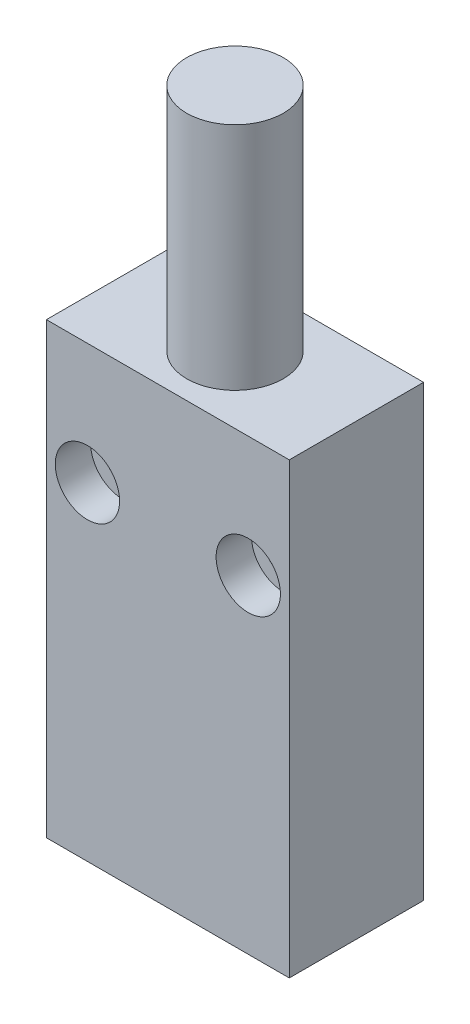
ISO-10303-21;
HEADER;
FILE_DESCRIPTION(('STEP AP214'),'2;1');
FILE_NAME('part.step','',(''),(''),'','','');
FILE_SCHEMA(('AUTOMOTIVE_DESIGN { 1 0 10303 214 1 1 1 1 }'));
ENDSEC;
DATA;
#1=APPLICATION_CONTEXT('core data for automotive mechanical design processes');
#2=APPLICATION_PROTOCOL_DEFINITION('international standard','automotive_design',2000,#1);
#3=PRODUCT_CONTEXT('',#1,'mechanical');
#4=PRODUCT('Part','Part','',(#3));
#5=PRODUCT_RELATED_PRODUCT_CATEGORY('part','',(#4));
#6=PRODUCT_DEFINITION_FORMATION('','',#4);
#7=PRODUCT_DEFINITION_CONTEXT('part definition',#1,'design');
#8=PRODUCT_DEFINITION('design','',#6,#7);
#9=PRODUCT_DEFINITION_SHAPE('','',#8);
#10=(LENGTH_UNIT() NAMED_UNIT(*) SI_UNIT(.MILLI.,.METRE.));
#11=(NAMED_UNIT(*) PLANE_ANGLE_UNIT() SI_UNIT($,.RADIAN.));
#12=(NAMED_UNIT(*) SI_UNIT($,.STERADIAN.) SOLID_ANGLE_UNIT());
#13=UNCERTAINTY_MEASURE_WITH_UNIT(LENGTH_MEASURE(1.E-05),#10,'distance_accuracy_value','');
#14=(GEOMETRIC_REPRESENTATION_CONTEXT(3) GLOBAL_UNCERTAINTY_ASSIGNED_CONTEXT((#13)) GLOBAL_UNIT_ASSIGNED_CONTEXT((#10,
#11,#12)) REPRESENTATION_CONTEXT('',''));
#15=CARTESIAN_POINT('',(0.,0.,0.));
#16=DIRECTION('',(0.,0.,1.));
#17=DIRECTION('',(1.,0.,0.));
#18=AXIS2_PLACEMENT_3D('',#15,#16,#17);
#19=CARTESIAN_POINT('',(-15.1,-27.9,8.35));
#20=DIRECTION('',(1.,0.,0.));
#21=DIRECTION('',(0.,0.,-1.));
#22=AXIS2_PLACEMENT_3D('',#19,#20,#21);
#23=PLANE('',#22);
#24=DIRECTION('',(0.,-1.,0.));
#25=VECTOR('',#24,1.);
#26=CARTESIAN_POINT('',(-15.1,-27.9,-8.35));
#27=LINE('',#26,#25);
#28=CARTESIAN_POINT('',(-15.1,27.9,-8.35));
#29=VERTEX_POINT('',#28);
#30=CARTESIAN_POINT('',(-15.1,-27.9,-8.35));
#31=VERTEX_POINT('',#30);
#32=EDGE_CURVE('E100',#29,#31,#27,.T.);
#33=ORIENTED_EDGE('',*,*,#32,.T.);
#34=DIRECTION('',(0.,0.,-1.));
#35=VECTOR('',#34,1.);
#36=CARTESIAN_POINT('',(-15.1,-27.9,8.35));
#37=LINE('',#36,#35);
#38=CARTESIAN_POINT('',(-15.1,-27.9,8.35));
#39=VERTEX_POINT('',#38);
#40=EDGE_CURVE('E42',#39,#31,#37,.T.);
#41=ORIENTED_EDGE('',*,*,#40,.F.);
#42=DIRECTION('',(0.,-1.,0.));
#43=VECTOR('',#42,1.);
#44=CARTESIAN_POINT('',(-15.1,-27.9,8.35));
#45=LINE('',#44,#43);
#46=CARTESIAN_POINT('',(-15.1,27.9,8.35));
#47=VERTEX_POINT('',#46);
#48=EDGE_CURVE('E86',#47,#39,#45,.T.);
#49=ORIENTED_EDGE('',*,*,#48,.F.);
#50=DIRECTION('',(0.,0.,-1.));
#51=VECTOR('',#50,1.);
#52=CARTESIAN_POINT('',(-15.1,27.9,8.35));
#53=LINE('',#52,#51);
#54=EDGE_CURVE('E96',#47,#29,#53,.T.);
#55=ORIENTED_EDGE('',*,*,#54,.T.);
#56=EDGE_LOOP('',(#33,#41,#49,#55));
#57=FACE_BOUND('',#56,.T.);
#58=ADVANCED_FACE('F34',(#57),#23,.F.);
#59=CARTESIAN_POINT('',(15.1,-27.9,8.35));
#60=DIRECTION('',(0.,1.,0.));
#61=DIRECTION('',(-1.,0.,0.));
#62=AXIS2_PLACEMENT_3D('',#59,#60,#61);
#63=PLANE('',#62);
#64=DIRECTION('',(1.,0.,0.));
#65=VECTOR('',#64,1.);
#66=CARTESIAN_POINT('',(15.1,-27.9,-8.35));
#67=LINE('',#66,#65);
#68=CARTESIAN_POINT('',(15.1,-27.9,-8.35));
#69=VERTEX_POINT('',#68);
#70=EDGE_CURVE('E91',#31,#69,#67,.T.);
#71=ORIENTED_EDGE('',*,*,#70,.T.);
#72=DIRECTION('',(0.,0.,-1.));
#73=VECTOR('',#72,1.);
#74=CARTESIAN_POINT('',(15.1,-27.9,8.35));
#75=LINE('',#74,#73);
#76=CARTESIAN_POINT('',(15.1,-27.9,8.35));
#77=VERTEX_POINT('',#76);
#78=EDGE_CURVE('E89',#77,#69,#75,.T.);
#79=ORIENTED_EDGE('',*,*,#78,.F.);
#80=DIRECTION('',(1.,0.,0.));
#81=VECTOR('',#80,1.);
#82=CARTESIAN_POINT('',(15.1,-27.9,8.35));
#83=LINE('',#82,#81);
#84=EDGE_CURVE('E81',#39,#77,#83,.T.);
#85=ORIENTED_EDGE('',*,*,#84,.F.);
#86=ORIENTED_EDGE('',*,*,#40,.T.);
#87=EDGE_LOOP('',(#71,#79,#85,#86));
#88=FACE_BOUND('',#87,.T.);
#89=ADVANCED_FACE('F90',(#88),#63,.F.);
#90=CARTESIAN_POINT('',(15.1,-27.9,8.35));
#91=DIRECTION('',(-1.,0.,0.));
#92=DIRECTION('',(0.,0.,1.));
#93=AXIS2_PLACEMENT_3D('',#90,#91,#92);
#94=PLANE('',#93);
#95=DIRECTION('',(0.,1.,0.));
#96=VECTOR('',#95,1.);
#97=CARTESIAN_POINT('',(15.1,-27.9,-8.35));
#98=LINE('',#97,#96);
#99=CARTESIAN_POINT('',(15.1,27.9,-8.35));
#100=VERTEX_POINT('',#99);
#101=EDGE_CURVE('E67',#69,#100,#98,.T.);
#102=ORIENTED_EDGE('',*,*,#101,.T.);
#103=DIRECTION('',(0.,0.,-1.));
#104=VECTOR('',#103,1.);
#105=CARTESIAN_POINT('',(15.1,27.9,8.35));
#106=LINE('',#105,#104);
#107=CARTESIAN_POINT('',(15.1,27.9,8.35));
#108=VERTEX_POINT('',#107);
#109=EDGE_CURVE('E92',#108,#100,#106,.T.);
#110=ORIENTED_EDGE('',*,*,#109,.F.);
#111=DIRECTION('',(0.,1.,0.));
#112=VECTOR('',#111,1.);
#113=CARTESIAN_POINT('',(15.1,-27.9,8.35));
#114=LINE('',#113,#112);
#115=EDGE_CURVE('E84',#77,#108,#114,.T.);
#116=ORIENTED_EDGE('',*,*,#115,.F.);
#117=ORIENTED_EDGE('',*,*,#78,.T.);
#118=EDGE_LOOP('',(#102,#110,#116,#117));
#119=FACE_BOUND('',#118,.T.);
#120=ADVANCED_FACE('F94',(#119),#94,.F.);
#121=CARTESIAN_POINT('',(15.1,27.9,8.35));
#122=DIRECTION('',(0.,-1.,0.));
#123=DIRECTION('',(1.,0.,0.));
#124=AXIS2_PLACEMENT_3D('',#121,#122,#123);
#125=PLANE('',#124);
#126=CARTESIAN_POINT('',(0.,27.9,0.));
#127=DIRECTION('',(0.,-1.,0.));
#128=DIRECTION('',(1.,0.,0.));
#129=AXIS2_PLACEMENT_3D('',#126,#127,#128);
#130=CIRCLE('',#129,6.);
#131=CARTESIAN_POINT('',(5.99999999999999,27.9,0.));
#132=VERTEX_POINT('',#131);
#133=EDGE_CURVE('E11',#132,#132,#130,.F.);
#134=ORIENTED_EDGE('',*,*,#133,.F.);
#135=EDGE_LOOP('',(#134));
#136=FACE_BOUND('',#135,.T.);
#137=DIRECTION('',(-1.,0.,0.));
#138=VECTOR('',#137,1.);
#139=CARTESIAN_POINT('',(15.1,27.9,-8.35));
#140=LINE('',#139,#138);
#141=EDGE_CURVE('E73',#100,#29,#140,.T.);
#142=ORIENTED_EDGE('',*,*,#141,.T.);
#143=ORIENTED_EDGE('',*,*,#54,.F.);
#144=DIRECTION('',(-1.,0.,0.));
#145=VECTOR('',#144,1.);
#146=CARTESIAN_POINT('',(15.1,27.9,8.35));
#147=LINE('',#146,#145);
#148=EDGE_CURVE('E50',#108,#47,#147,.T.);
#149=ORIENTED_EDGE('',*,*,#148,.F.);
#150=ORIENTED_EDGE('',*,*,#109,.T.);
#151=EDGE_LOOP('',(#142,#143,#149,#150));
#152=FACE_BOUND('',#151,.T.);
#153=ADVANCED_FACE('F123',(#136,#152),#125,.F.);
#154=CARTESIAN_POINT('',(0.,0.,8.35));
#155=DIRECTION('',(0.,0.,1.));
#156=DIRECTION('',(1.,0.,0.));
#157=AXIS2_PLACEMENT_3D('',#154,#155,#156);
#158=PLANE('',#157);
#159=CARTESIAN_POINT('',(-10.,12.9,8.35));
#160=DIRECTION('',(0.,0.,1.));
#161=DIRECTION('',(1.,0.,0.));
#162=AXIS2_PLACEMENT_3D('',#159,#160,#161);
#163=CIRCLE('',#162,3.99999999999999);
#164=CARTESIAN_POINT('',(-6.00000000000001,12.9,8.35));
#165=VERTEX_POINT('',#164);
#166=EDGE_CURVE('E200',#165,#165,#163,.T.);
#167=ORIENTED_EDGE('',*,*,#166,.F.);
#168=EDGE_LOOP('',(#167));
#169=FACE_BOUND('',#168,.T.);
#170=CARTESIAN_POINT('',(10.,12.9,8.35));
#171=DIRECTION('',(0.,0.,1.));
#172=DIRECTION('',(1.,0.,0.));
#173=AXIS2_PLACEMENT_3D('',#170,#171,#172);
#174=CIRCLE('',#173,3.99999999999999);
#175=CARTESIAN_POINT('',(14.,12.9,8.35));
#176=VERTEX_POINT('',#175);
#177=EDGE_CURVE('E182',#176,#176,#174,.T.);
#178=ORIENTED_EDGE('',*,*,#177,.F.);
#179=EDGE_LOOP('',(#178));
#180=FACE_BOUND('',#179,.T.);
#181=ORIENTED_EDGE('',*,*,#48,.T.);
#182=ORIENTED_EDGE('',*,*,#84,.T.);
#183=ORIENTED_EDGE('',*,*,#115,.T.);
#184=ORIENTED_EDGE('',*,*,#148,.T.);
#185=EDGE_LOOP('',(#181,#182,#183,#184));
#186=FACE_BOUND('',#185,.T.);
#187=ADVANCED_FACE('F82',(#169,#180,#186),#158,.T.);
#188=CARTESIAN_POINT('',(0.,0.,-8.35));
#189=DIRECTION('',(0.,0.,1.));
#190=DIRECTION('',(1.,0.,0.));
#191=AXIS2_PLACEMENT_3D('',#188,#189,#190);
#192=PLANE('',#191);
#193=CARTESIAN_POINT('',(-10.,12.9,-8.35));
#194=DIRECTION('',(0.,0.,1.));
#195=DIRECTION('',(1.,0.,0.));
#196=AXIS2_PLACEMENT_3D('',#193,#194,#195);
#197=CIRCLE('',#196,2.25);
#198=CARTESIAN_POINT('',(-7.75,12.9,-8.35));
#199=VERTEX_POINT('',#198);
#200=EDGE_CURVE('E186',#199,#199,#197,.T.);
#201=ORIENTED_EDGE('',*,*,#200,.T.);
#202=EDGE_LOOP('',(#201));
#203=FACE_BOUND('',#202,.T.);
#204=CARTESIAN_POINT('',(10.,12.9,-8.35));
#205=DIRECTION('',(0.,0.,1.));
#206=DIRECTION('',(1.,0.,0.));
#207=AXIS2_PLACEMENT_3D('',#204,#205,#206);
#208=CIRCLE('',#207,2.25);
#209=CARTESIAN_POINT('',(12.25,12.9,-8.35));
#210=VERTEX_POINT('',#209);
#211=EDGE_CURVE('E103',#210,#210,#208,.T.);
#212=ORIENTED_EDGE('',*,*,#211,.T.);
#213=EDGE_LOOP('',(#212));
#214=FACE_BOUND('',#213,.T.);
#215=ORIENTED_EDGE('',*,*,#32,.F.);
#216=ORIENTED_EDGE('',*,*,#141,.F.);
#217=ORIENTED_EDGE('',*,*,#101,.F.);
#218=ORIENTED_EDGE('',*,*,#70,.F.);
#219=EDGE_LOOP('',(#215,#216,#217,#218));
#220=FACE_BOUND('',#219,.T.);
#221=ADVANCED_FACE('F111',(#203,#214,#220),#192,.F.);
#222=CARTESIAN_POINT('',(10.,12.9,8.35));
#223=DIRECTION('',(0.,0.,1.));
#224=DIRECTION('',(1.,0.,0.));
#225=AXIS2_PLACEMENT_3D('',#222,#223,#224);
#226=CYLINDRICAL_SURFACE('',#225,2.25);
#227=ORIENTED_EDGE('',*,*,#211,.F.);
#228=EDGE_LOOP('',(#227));
#229=FACE_BOUND('',#228,.T.);
#230=CARTESIAN_POINT('',(10.,12.9,3.95));
#231=DIRECTION('',(0.,0.,1.));
#232=DIRECTION('',(1.,0.,0.));
#233=AXIS2_PLACEMENT_3D('',#230,#231,#232);
#234=CIRCLE('',#233,2.25);
#235=CARTESIAN_POINT('',(12.25,12.9,3.95));
#236=VERTEX_POINT('',#235);
#237=EDGE_CURVE('E178',#236,#236,#234,.T.);
#238=ORIENTED_EDGE('',*,*,#237,.T.);
#239=EDGE_LOOP('',(#238));
#240=FACE_BOUND('',#239,.T.);
#241=ADVANCED_FACE('F113',(#229,#240),#226,.F.);
#242=CARTESIAN_POINT('',(12.25,12.9,3.95));
#243=DIRECTION('',(0.,0.,-1.));
#244=DIRECTION('',(-1.,0.,0.));
#245=AXIS2_PLACEMENT_3D('',#242,#243,#244);
#246=PLANE('',#245);
#247=ORIENTED_EDGE('',*,*,#237,.F.);
#248=EDGE_LOOP('',(#247));
#249=FACE_BOUND('',#248,.T.);
#250=CARTESIAN_POINT('',(10.,12.9,3.95));
#251=DIRECTION('',(0.,0.,1.));
#252=DIRECTION('',(1.,0.,0.));
#253=AXIS2_PLACEMENT_3D('',#250,#251,#252);
#254=CIRCLE('',#253,4.);
#255=CARTESIAN_POINT('',(14.,12.9,3.95));
#256=VERTEX_POINT('',#255);
#257=EDGE_CURVE('E181',#256,#256,#254,.T.);
#258=ORIENTED_EDGE('',*,*,#257,.T.);
#259=EDGE_LOOP('',(#258));
#260=FACE_BOUND('',#259,.T.);
#261=ADVANCED_FACE('F120',(#249,#260),#246,.F.);
#262=CARTESIAN_POINT('',(10.,12.9,8.35));
#263=DIRECTION('',(0.,0.,1.));
#264=DIRECTION('',(1.,0.,0.));
#265=AXIS2_PLACEMENT_3D('',#262,#263,#264);
#266=CYLINDRICAL_SURFACE('',#265,3.99999999999999);
#267=ORIENTED_EDGE('',*,*,#257,.F.);
#268=EDGE_LOOP('',(#267));
#269=FACE_BOUND('',#268,.T.);
#270=ORIENTED_EDGE('',*,*,#177,.T.);
#271=EDGE_LOOP('',(#270));
#272=FACE_BOUND('',#271,.T.);
#273=ADVANCED_FACE('F166',(#269,#272),#266,.F.);
#274=CARTESIAN_POINT('',(-10.,12.9,8.35));
#275=DIRECTION('',(0.,0.,1.));
#276=DIRECTION('',(1.,0.,0.));
#277=AXIS2_PLACEMENT_3D('',#274,#275,#276);
#278=CYLINDRICAL_SURFACE('',#277,2.25);
#279=ORIENTED_EDGE('',*,*,#200,.F.);
#280=EDGE_LOOP('',(#279));
#281=FACE_BOUND('',#280,.T.);
#282=CARTESIAN_POINT('',(-10.,12.9,3.95));
#283=DIRECTION('',(0.,0.,1.));
#284=DIRECTION('',(1.,0.,0.));
#285=AXIS2_PLACEMENT_3D('',#282,#283,#284);
#286=CIRCLE('',#285,2.25);
#287=CARTESIAN_POINT('',(-7.75,12.9,3.95));
#288=VERTEX_POINT('',#287);
#289=EDGE_CURVE('E194',#288,#288,#286,.T.);
#290=ORIENTED_EDGE('',*,*,#289,.T.);
#291=EDGE_LOOP('',(#290));
#292=FACE_BOUND('',#291,.T.);
#293=ADVANCED_FACE('F162',(#281,#292),#278,.F.);
#294=CARTESIAN_POINT('',(-7.75,12.9,3.95));
#295=DIRECTION('',(0.,0.,-1.));
#296=DIRECTION('',(-1.,0.,0.));
#297=AXIS2_PLACEMENT_3D('',#294,#295,#296);
#298=PLANE('',#297);
#299=ORIENTED_EDGE('',*,*,#289,.F.);
#300=EDGE_LOOP('',(#299));
#301=FACE_BOUND('',#300,.T.);
#302=CARTESIAN_POINT('',(-10.,12.9,3.95));
#303=DIRECTION('',(0.,0.,1.));
#304=DIRECTION('',(1.,0.,0.));
#305=AXIS2_PLACEMENT_3D('',#302,#303,#304);
#306=CIRCLE('',#305,4.);
#307=CARTESIAN_POINT('',(-6.,12.9,3.95));
#308=VERTEX_POINT('',#307);
#309=EDGE_CURVE('E197',#308,#308,#306,.T.);
#310=ORIENTED_EDGE('',*,*,#309,.T.);
#311=EDGE_LOOP('',(#310));
#312=FACE_BOUND('',#311,.T.);
#313=ADVANCED_FACE('F155',(#301,#312),#298,.F.);
#314=CARTESIAN_POINT('',(-10.,12.9,8.35));
#315=DIRECTION('',(0.,0.,1.));
#316=DIRECTION('',(1.,0.,0.));
#317=AXIS2_PLACEMENT_3D('',#314,#315,#316);
#318=CYLINDRICAL_SURFACE('',#317,3.99999999999999);
#319=ORIENTED_EDGE('',*,*,#309,.F.);
#320=EDGE_LOOP('',(#319));
#321=FACE_BOUND('',#320,.T.);
#322=ORIENTED_EDGE('',*,*,#166,.T.);
#323=EDGE_LOOP('',(#322));
#324=FACE_BOUND('',#323,.T.);
#325=ADVANCED_FACE('F146',(#321,#324),#318,.F.);
#326=CARTESIAN_POINT('',(0.,56.5,0.));
#327=DIRECTION('',(0.,-1.,0.));
#328=DIRECTION('',(1.,0.,0.));
#329=AXIS2_PLACEMENT_3D('',#326,#327,#328);
#330=CYLINDRICAL_SURFACE('',#329,6.);
#331=CARTESIAN_POINT('',(0.,56.5,0.));
#332=DIRECTION('',(0.,1.,0.));
#333=DIRECTION('',(0.,0.,1.));
#334=AXIS2_PLACEMENT_3D('',#331,#332,#333);
#335=CIRCLE('',#334,6.);
#336=CARTESIAN_POINT('',(0.,56.5,6.));
#337=VERTEX_POINT('',#336);
#338=EDGE_CURVE('E203',#337,#337,#335,.T.);
#339=ORIENTED_EDGE('',*,*,#338,.F.);
#340=EDGE_LOOP('',(#339));
#341=FACE_BOUND('',#340,.T.);
#342=ORIENTED_EDGE('',*,*,#133,.T.);
#343=EDGE_LOOP('',(#342));
#344=FACE_BOUND('',#343,.T.);
#345=ADVANCED_FACE('F143',(#341,#344),#330,.T.);
#346=CARTESIAN_POINT('',(0.,56.5,0.));
#347=DIRECTION('',(0.,1.,0.));
#348=DIRECTION('',(0.,0.,1.));
#349=AXIS2_PLACEMENT_3D('',#346,#347,#348);
#350=PLANE('',#349);
#351=ORIENTED_EDGE('',*,*,#338,.T.);
#352=EDGE_LOOP('',(#351));
#353=FACE_BOUND('',#352,.T.);
#354=ADVANCED_FACE('F145',(#353),#350,.T.);
#355=CLOSED_SHELL('',(#58,#89,#120,#153,#187,#221,#241,#261,#273,#293,#313,#325,#345,#354));
#356=MANIFOLD_SOLID_BREP('B2',#355);
#357=ADVANCED_BREP_SHAPE_REPRESENTATION('',(#18,#356),#14);
#358=SHAPE_DEFINITION_REPRESENTATION(#9,#357);
ENDSEC;
END-ISO-10303-21;
